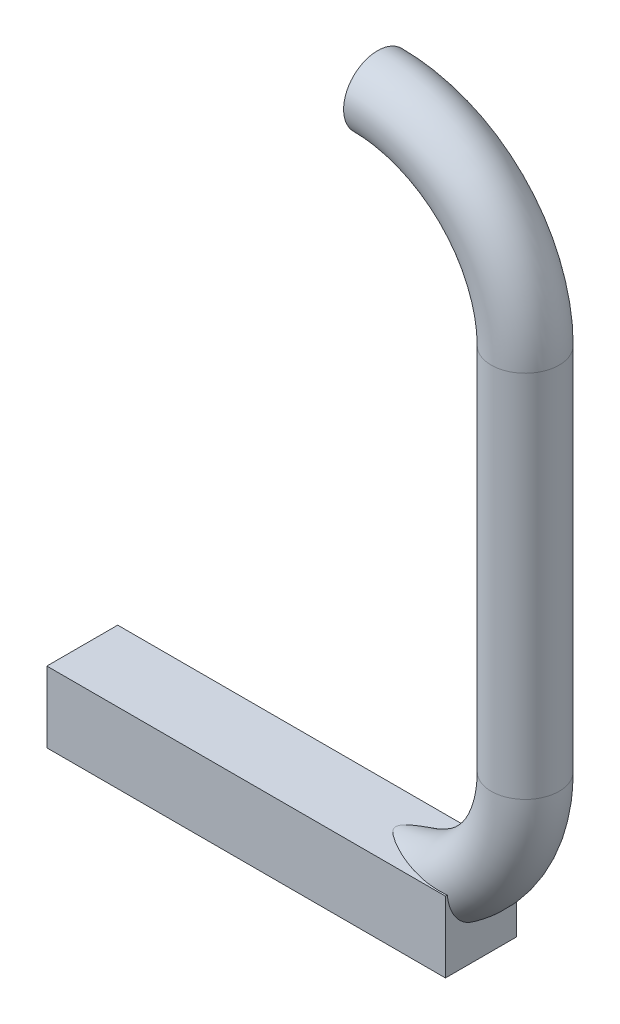
ISO-10303-21;
HEADER;
FILE_DESCRIPTION(('STEP AP214'),'2;1');
FILE_NAME('part.step','',(''),(''),'','','');
FILE_SCHEMA(('AUTOMOTIVE_DESIGN { 1 0 10303 214 1 1 1 1 }'));
ENDSEC;
DATA;
#1=APPLICATION_CONTEXT('core data for automotive mechanical design processes');
#2=APPLICATION_PROTOCOL_DEFINITION('international standard','automotive_design',2000,#1);
#3=PRODUCT_CONTEXT('',#1,'mechanical');
#4=PRODUCT('Part','Part','',(#3));
#5=PRODUCT_RELATED_PRODUCT_CATEGORY('part','',(#4));
#6=PRODUCT_DEFINITION_FORMATION('','',#4);
#7=PRODUCT_DEFINITION_CONTEXT('part definition',#1,'design');
#8=PRODUCT_DEFINITION('design','',#6,#7);
#9=PRODUCT_DEFINITION_SHAPE('','',#8);
#10=(LENGTH_UNIT() NAMED_UNIT(*) SI_UNIT(.MILLI.,.METRE.));
#11=(NAMED_UNIT(*) PLANE_ANGLE_UNIT() SI_UNIT($,.RADIAN.));
#12=(NAMED_UNIT(*) SI_UNIT($,.STERADIAN.) SOLID_ANGLE_UNIT());
#13=UNCERTAINTY_MEASURE_WITH_UNIT(LENGTH_MEASURE(1.E-05),#10,'distance_accuracy_value','');
#14=(GEOMETRIC_REPRESENTATION_CONTEXT(3) GLOBAL_UNCERTAINTY_ASSIGNED_CONTEXT((#13)) GLOBAL_UNIT_ASSIGNED_CONTEXT((#10,
#11,#12)) REPRESENTATION_CONTEXT('',''));
#15=CARTESIAN_POINT('',(0.,0.,0.));
#16=DIRECTION('',(0.,0.,1.));
#17=DIRECTION('',(1.,0.,0.));
#18=AXIS2_PLACEMENT_3D('',#15,#16,#17);
#19=CARTESIAN_POINT('',(-10.,35.,0.));
#20=DIRECTION('',(1.,0.,0.));
#21=DIRECTION('',(0.,0.,-1.));
#22=AXIS2_PLACEMENT_3D('',#19,#20,#21);
#23=PLANE('',#22);
#24=CARTESIAN_POINT('',(-10.,35.,0.));
#25=DIRECTION('',(1.,0.,0.));
#26=DIRECTION('',(0.,0.,-1.));
#27=AXIS2_PLACEMENT_3D('',#24,#25,#26);
#28=CIRCLE('',#27,2.3);
#29=CARTESIAN_POINT('',(-10.,35.,-2.3));
#30=VERTEX_POINT('',#29);
#31=EDGE_CURVE('E66',#30,#30,#28,.T.);
#32=ORIENTED_EDGE('',*,*,#31,.F.);
#33=EDGE_LOOP('',(#32));
#34=FACE_BOUND('',#33,.T.);
#35=ADVANCED_FACE('F45',(#34),#23,.F.);
#36=CARTESIAN_POINT('',(-10.,0.,0.));
#37=DIRECTION('',(0.,0.,1.));
#38=DIRECTION('',(1.,0.,0.));
#39=AXIS2_PLACEMENT_3D('',#36,#37,#38);
#40=TOROIDAL_SURFACE('',#39,10.,2.3);
#41=CARTESIAN_POINT('',(-3.,-10.0595204326185,-0.450923927062551));
#42=CARTESIAN_POINT('',(-3.,-10.0850865922936,-0.345966798105976));
#43=CARTESIAN_POINT('',(-3.,-10.1018228645208,-0.238853486872141));
#44=CARTESIAN_POINT('',(-3.,-10.1167855077667,-0.0233377880273383));
#45=CARTESIAN_POINT('',(-3.,-10.1150138796625,0.0850644589719768));
#46=CARTESIAN_POINT('',(-3.,-10.0930610314419,0.299909944396523));
#47=CARTESIAN_POINT('',(-3.,-10.0728903010278,0.406354263804018));
#48=CARTESIAN_POINT('',(-3.,-10.0151820905365,0.614404784386994));
#49=CARTESIAN_POINT('',(-3.,-9.97764186408039,0.716010217658566));
#50=CARTESIAN_POINT('',(-3.,-9.88633124866035,0.913262219490454));
#51=CARTESIAN_POINT('',(-3.,-9.83234909263179,1.00881011069813));
#52=CARTESIAN_POINT('',(-3.,-9.71060101828803,1.19062378822087));
#53=CARTESIAN_POINT('',(-3.,-9.64283195707754,1.27688745121321));
#54=CARTESIAN_POINT('',(-3.,-9.48793680595565,1.44778267188152));
#55=CARTESIAN_POINT('',(-3.,-9.3995107126304,1.53123220074621));
#56=CARTESIAN_POINT('',(-3.,-9.21173612037597,1.68471859938472));
#57=CARTESIAN_POINT('',(-3.,-9.11238016255341,1.75474621911467));
#58=CARTESIAN_POINT('',(-3.,-8.85901566705753,1.90976222676069));
#59=CARTESIAN_POINT('',(-3.,-8.70047646167985,1.98738077676751));
#60=CARTESIAN_POINT('',(-3.,-8.37289844722519,2.1157978195985));
#61=CARTESIAN_POINT('',(-3.,-8.20384107783171,2.16654730786618));
#62=CARTESIAN_POINT('',(-3.,-7.80444436848786,2.25588462186827));
#63=CARTESIAN_POINT('',(-3.,-7.57203681155976,2.28516716936277));
#64=CARTESIAN_POINT('',(-3.,-7.1055269592388,2.30607243195032));
#65=CARTESIAN_POINT('',(-3.,-6.87142253893703,2.29763448652288));
#66=CARTESIAN_POINT('',(-3.,-6.4874770172784,2.25668212424956));
#67=CARTESIAN_POINT('',(-3.,-6.33653659042456,2.23351975578051));
#68=CARTESIAN_POINT('',(-3.,-6.03719052203209,2.17435500890801));
#69=CARTESIAN_POINT('',(-3.,-5.88878477110618,2.13835318608286));
#70=CARTESIAN_POINT('',(-3.,-5.59529794018598,2.05434468515866));
#71=CARTESIAN_POINT('',(-3.,-5.45021985382563,2.00632762728168));
#72=CARTESIAN_POINT('',(-3.,-5.16442121321652,1.89884276295196));
#73=CARTESIAN_POINT('',(-3.,-5.02369875280009,1.83938005016144));
#74=CARTESIAN_POINT('',(-3.,-4.79786604169187,1.73275040870475));
#75=CARTESIAN_POINT('',(-3.,-4.71114060290708,1.68897479601162));
#76=CARTESIAN_POINT('',(-3.,-4.54026585710975,1.59666985711355));
#77=CARTESIAN_POINT('',(-3.,-4.45611602204963,1.54814151399361));
#78=CARTESIAN_POINT('',(-3.,-4.2910977947158,1.44616466449497));
#79=CARTESIAN_POINT('',(-3.,-4.21022251857459,1.39272734440282));
#80=CARTESIAN_POINT('',(-3.,-4.05239358013626,1.28038402767899));
#81=CARTESIAN_POINT('',(-3.,-3.97543790627031,1.22148088085713));
#82=CARTESIAN_POINT('',(-3.,-3.82449719832431,1.09560633289273));
#83=CARTESIAN_POINT('',(-3.,-3.75066578570998,1.02844878168371));
#84=CARTESIAN_POINT('',(-3.,-3.61080231328726,0.886267940210698));
#85=CARTESIAN_POINT('',(-3.,-3.54476856200611,0.811246362505232));
#86=CARTESIAN_POINT('',(-3.,-3.43941905296488,0.671294664782384));
#87=CARTESIAN_POINT('',(-3.,-3.39751058862841,0.608344911105427));
#88=CARTESIAN_POINT('',(-3.,-3.32375019878203,0.47678256158333));
#89=CARTESIAN_POINT('',(-3.,-3.29187431066808,0.408183960495214));
#90=CARTESIAN_POINT('',(-3.,-3.24826649964847,0.283696413882194));
#91=CARTESIAN_POINT('',(-3.,-3.23349659054943,0.228888316984574));
#92=CARTESIAN_POINT('',(-3.,-3.21341000927301,0.117575047145494));
#93=CARTESIAN_POINT('',(-3.,-3.20808155238705,0.0610720794806092));
#94=CARTESIAN_POINT('',(-3.,-3.20754543974805,-0.0520959634032782));
#95=CARTESIAN_POINT('',(-3.,-3.21235786023321,-0.108761137982623));
#96=CARTESIAN_POINT('',(-3.,-3.231512953531,-0.220463077517019));
#97=CARTESIAN_POINT('',(-3.,-3.24586681073588,-0.275497852154654));
#98=CARTESIAN_POINT('',(-3.,-3.28905866838386,-0.401753758158875));
#99=CARTESIAN_POINT('',(-3.,-3.32122322650039,-0.471818955766654));
#100=CARTESIAN_POINT('',(-3.,-3.39601893327519,-0.606120249813533));
#101=CARTESIAN_POINT('',(-3.,-3.43867889734456,-0.670339619884765));
#102=CARTESIAN_POINT('',(-3.,-3.52665466236531,-0.787157411605189));
#103=CARTESIAN_POINT('',(-3.,-3.57129276946506,-0.840277217326418));
#104=CARTESIAN_POINT('',(-3.,-3.66493783611536,-0.942552217917257));
#105=CARTESIAN_POINT('',(-3.,-3.71394845160234,-0.991704028417386));
#106=CARTESIAN_POINT('',(-3.,-3.81536468836965,-1.0865602288091));
#107=CARTESIAN_POINT('',(-3.,-3.86777718809988,-1.13225720235978));
#108=CARTESIAN_POINT('',(-3.,-3.97521980583419,-1.22047859984916));
#109=CARTESIAN_POINT('',(-3.,-4.03025089543214,-1.26300183094213));
#110=CARTESIAN_POINT('',(-3.,-4.19651684262932,-1.38479529253682));
#111=CARTESIAN_POINT('',(-3.,-4.31077444994434,-1.45995708648754));
#112=CARTESIAN_POINT('',(-3.,-4.54516861944771,-1.60054687824412));
#113=CARTESIAN_POINT('',(-3.,-4.66531011709101,-1.66596651176856));
#114=CARTESIAN_POINT('',(-3.,-4.91029616827658,-1.78765095208152));
#115=CARTESIAN_POINT('',(-3.,-5.03514558058968,-1.8439059634417));
#116=CARTESIAN_POINT('',(-3.,-5.28857467437189,-1.94726178017489));
#117=CARTESIAN_POINT('',(-3.,-5.41715464467042,-1.99436187456537));
#118=CARTESIAN_POINT('',(-3.,-5.68542892429698,-2.08176785176833));
#119=CARTESIAN_POINT('',(-3.,-5.82531986947735,-2.12147621260049));
#120=CARTESIAN_POINT('',(-3.,-6.10778472147352,-2.18966956330348));
#121=CARTESIAN_POINT('',(-3.,-6.25035923913416,-2.2181519647017));
#122=CARTESIAN_POINT('',(-3.,-6.68036807013816,-2.28536349974699));
#123=CARTESIAN_POINT('',(-3.,-6.97104176368199,-2.30617558321387));
#124=CARTESIAN_POINT('',(-3.,-7.46061826015328,-2.29304933287129));
#125=CARTESIAN_POINT('',(-3.,-7.65998015737501,-2.27411008517307));
#126=CARTESIAN_POINT('',(-3.,-8.05349637727916,-2.2055010868768));
#127=CARTESIAN_POINT('',(-3.,-8.24765618824872,-2.15586517038215));
#128=CARTESIAN_POINT('',(-3.,-8.58505056656731,-2.03633232647364));
#129=CARTESIAN_POINT('',(-3.,-8.73051314298438,-1.97274790414527));
#130=CARTESIAN_POINT('',(-3.,-9.00931297230137,-1.82287282312488));
#131=CARTESIAN_POINT('',(-3.,-9.14266350448063,-1.73660744552577));
#132=CARTESIAN_POINT('',(-3.,-9.36863174075163,-1.55907996774789));
#133=CARTESIAN_POINT('',(-3.,-9.46423635020208,-1.47162765317341));
#134=CARTESIAN_POINT('',(-3.,-9.63977221862251,-1.28214739272353));
#135=CARTESIAN_POINT('',(-3.,-9.71971688801582,-1.18013204851832));
#136=CARTESIAN_POINT('',(-3.,-9.85149487433779,-0.976605925974395));
#137=CARTESIAN_POINT('',(-3.,-9.90556610303361,-0.876546965349489));
#138=CARTESIAN_POINT('',(-3.,-9.99616494361971,-0.668755060287398));
#139=CARTESIAN_POINT('',(-3.,-10.0327010653546,-0.561025867448519));
#140=CARTESIAN_POINT('',(-3.,-10.0595204326185,-0.450923927062551));
#141=B_SPLINE_CURVE_WITH_KNOTS('',3,(#41,#42,#43,#44,#45,#46,#47,#48,#49,#50,#51,#52,#53,#54,
#55,#56,#57,#58,#59,#60,#61,#62,#63,#64,#65,#66,#67,#68,#69,#70,#71,#72,#73,#74,#75,#76,#77,#78,
#79,#80,#81,#82,#83,#84,#85,#86,#87,#88,#89,#90,#91,#92,#93,#94,#95,#96,#97,#98,#99,#100,#101,
#102,#103,#104,#105,#106,#107,#108,#109,#110,#111,#112,#113,#114,#115,#116,#117,#118,#119,#120,
#121,#122,#123,#124,#125,#126,#127,#128,#129,#130,#131,#132,#133,#134,#135,#136,#137,#138,#139,
#140),.UNSPECIFIED.,.T.,.F.,(4,2,2,2,2,2,2,2,2,2,2,2,2,2,2,2,2,2,2,2,2,2,2,2,2,2,2,2,2,2,2,2,2,
2,2,2,2,2,2,2,2,2,2,2,2,2,2,2,2,4),(0.,0.323685531492289,0.647336069911499,0.970802203828777,
1.29431950010235,1.6221936838384,1.95014269446515,2.31350343432469,2.67711369990452,
3.20375399239772,3.73135150617938,4.43032848590882,5.13042993522063,5.58802876879848,
6.04560780393871,6.50358350763297,6.96135586756634,7.25267040049132,7.54392480282116,
7.83453123909231,8.12498699935451,8.42397313702059,8.72289429885295,8.949147683604,
9.17485649211519,9.34444416624477,9.51382001354154,9.68353149493556,9.85344226233903,
10.0834205355146,10.3140374076898,10.5218927567197,10.7299235561084,10.9383889423522,
11.1469322894674,11.5565845837529,11.9665865882934,12.3770239805177,12.7874932351094,
13.2232563367553,13.6591198576038,14.5278618301809,15.1267435200429,15.7249662914802,
16.1994797247986,16.6734664725434,17.0606301567534,17.4474608289919,17.7871778813569,
18.1267299008001),.UNSPECIFIED.);
#142=CARTESIAN_POINT('',(-3.,-7.6,-2.27584306344525));
#143=VERTEX_POINT('',#142);
#144=CARTESIAN_POINT('',(-3.,-7.6,2.27584306344519));
#145=VERTEX_POINT('',#144);
#146=EDGE_CURVE('E56',#143,#145,#141,.T.);
#147=ORIENTED_EDGE('',*,*,#146,.F.);
#148=CARTESIAN_POINT('',(-8.76106516328514,-7.6,-0.0384874427780604));
#149=CARTESIAN_POINT('',(-8.76336745512046,-7.6,-0.0163076647818836));
#150=CARTESIAN_POINT('',(-8.76368354584691,-7.6,0.00610174449860957));
#151=CARTESIAN_POINT('',(-8.7602780285064,-7.6,0.050605825243175));
#152=CARTESIAN_POINT('',(-8.7565533131262,-7.6,0.0727002412371014));
#153=CARTESIAN_POINT('',(-8.74415273225032,-7.6,0.121689200166704));
#154=CARTESIAN_POINT('',(-8.73443001200933,-7.6,0.148312580619611));
#155=CARTESIAN_POINT('',(-8.71092306107291,-7.6,0.199700397722118));
#156=CARTESIAN_POINT('',(-8.69712691934324,-7.6,0.224459111652509));
#157=CARTESIAN_POINT('',(-8.66375926401956,-7.6,0.276963169015735));
#158=CARTESIAN_POINT('',(-8.64358456218863,-7.6,0.304316569600383));
#159=CARTESIAN_POINT('',(-8.60069675648798,-7.6,0.356982318017975));
#160=CARTESIAN_POINT('',(-8.57797881071123,-7.6,0.382290609076778));
#161=CARTESIAN_POINT('',(-8.53072229662973,-7.6,0.431429046384539));
#162=CARTESIAN_POINT('',(-8.50617331872111,-7.6,0.455249061080922));
#163=CARTESIAN_POINT('',(-8.45591175864558,-7.6,0.50156570179265));
#164=CARTESIAN_POINT('',(-8.43020026816034,-7.6,0.524063525574512));
#165=CARTESIAN_POINT('',(-8.35018341661451,-7.6,0.591365096243037));
#166=CARTESIAN_POINT('',(-8.29448581460041,-7.6,0.634507302628828));
#167=CARTESIAN_POINT('',(-8.1809350488034,-7.6,0.717876129763391));
#168=CARTESIAN_POINT('',(-8.12308031674518,-7.6,0.758100564094274));
#169=CARTESIAN_POINT('',(-8.00578344977357,-7.6,0.836438577242294));
#170=CARTESIAN_POINT('',(-7.94633816716617,-7.6,0.874547428009476));
#171=CARTESIAN_POINT('',(-7.82634836543142,-7.6,0.948998789112317));
#172=CARTESIAN_POINT('',(-7.76580370079169,-7.6,0.985341063251358));
#173=CARTESIAN_POINT('',(-7.58265877877051,-7.6,1.09224266896904));
#174=CARTESIAN_POINT('',(-7.45874068279682,-7.6,1.16055099614725));
#175=CARTESIAN_POINT('',(-7.20843153181569,-7.6,1.29201654085484));
#176=CARTESIAN_POINT('',(-7.08204384651307,-7.6,1.35518024218859));
#177=CARTESIAN_POINT('',(-6.74396172047494,-7.6,1.51617947177852));
#178=CARTESIAN_POINT('',(-6.5302579020165,-7.6,1.60984027517238));
#179=CARTESIAN_POINT('',(-6.09694068122383,-7.6,1.78296132569362));
#180=CARTESIAN_POINT('',(-5.8773223166303,-7.6,1.86240919237886));
#181=CARTESIAN_POINT('',(-5.43377892346578,-7.6,2.00423250490061));
#182=CARTESIAN_POINT('',(-5.20988093762913,-7.6,2.06669137408837));
#183=CARTESIAN_POINT('',(-4.75750441952767,-7.6,2.17178324850581));
#184=CARTESIAN_POINT('',(-4.52902822197315,-7.6,2.21442610358707));
#185=CARTESIAN_POINT('',(-4.05329032030783,-7.6,2.27792287317266));
#186=CARTESIAN_POINT('',(-3.80579656658777,-7.6,2.29712330020667));
#187=CARTESIAN_POINT('',(-3.31006826701693,-7.6,2.30227961027013));
#188=CARTESIAN_POINT('',(-3.06183364135996,-7.6,2.28823177248211));
#189=CARTESIAN_POINT('',(-2.61689143468955,-7.6,2.22616057736104));
#190=CARTESIAN_POINT('',(-2.41925426657746,-7.6,2.18500596755682));
#191=CARTESIAN_POINT('',(-2.03294356913534,-7.6,2.07183091496381));
#192=CARTESIAN_POINT('',(-1.84425479039484,-7.6,1.99986524469287));
#193=CARTESIAN_POINT('',(-1.53327215252863,-7.6,1.84586875798378));
#194=CARTESIAN_POINT('',(-1.40694964596323,-7.6,1.77199542395462));
#195=CARTESIAN_POINT('',(-1.16756428787725,-7.6,1.60512188886672));
#196=CARTESIAN_POINT('',(-1.05448584184775,-7.6,1.51214454505752));
#197=CARTESIAN_POINT('',(-0.865315117179502,-7.6,1.32540192997881));
#198=CARTESIAN_POINT('',(-0.786219043340599,-7.6,1.23469035583397));
#199=CARTESIAN_POINT('',(-0.644012137334367,-7.6,1.04140472431223));
#200=CARTESIAN_POINT('',(-0.580895862654296,-7.6,0.938834723146037));
#201=CARTESIAN_POINT('',(-0.473711533522327,-7.6,0.723180144342138));
#202=CARTESIAN_POINT('',(-0.429779886446887,-7.6,0.610027001012858));
#203=CARTESIAN_POINT('',(-0.364588327368235,-7.6,0.377355504592211));
#204=CARTESIAN_POINT('',(-0.3433123936587,-7.6,0.257841712520241));
#205=CARTESIAN_POINT('',(-0.326079630234177,-7.6,0.0317091322237236));
#206=CARTESIAN_POINT('',(-0.327352658772131,-7.6,-0.0747057133016944));
#207=CARTESIAN_POINT('',(-0.348448470927228,-7.6,-0.285655333252143));
#208=CARTESIAN_POINT('',(-0.368266891221725,-7.6,-0.39019054401764));
#209=CARTESIAN_POINT('',(-0.424330994369228,-7.6,-0.590860124880144));
#210=CARTESIAN_POINT('',(-0.45999405900148,-7.6,-0.687159366275498));
#211=CARTESIAN_POINT('',(-0.545816476709432,-7.6,-0.873023596316549));
#212=CARTESIAN_POINT('',(-0.595978261926194,-7.6,-0.962587451931074));
#213=CARTESIAN_POINT('',(-0.713230524228457,-7.6,-1.14031141654994));
#214=CARTESIAN_POINT('',(-0.781353729036768,-7.6,-1.2277869570745));
#215=CARTESIAN_POINT('',(-0.929364505230641,-7.6,-1.39208751767257));
#216=CARTESIAN_POINT('',(-1.00925893658261,-7.6,-1.46890627621963));
#217=CARTESIAN_POINT('',(-1.21688994804331,-7.6,-1.64405208728221));
#218=CARTESIAN_POINT('',(-1.34983591404349,-7.6,-1.73622575498108));
#219=CARTESIAN_POINT('',(-1.6289202771372,-7.6,-1.89782465763377));
#220=CARTESIAN_POINT('',(-1.77508631340205,-7.6,-1.96720075910756));
#221=CARTESIAN_POINT('',(-2.13287295036862,-7.6,-2.10719761437403));
#222=CARTESIAN_POINT('',(-2.3482246420962,-7.6,-2.16823369493722));
#223=CARTESIAN_POINT('',(-2.78560156175981,-7.6,-2.25546474153732));
#224=CARTESIAN_POINT('',(-3.00763257356028,-7.6,-2.28162856730029));
#225=CARTESIAN_POINT('',(-3.39939569692146,-7.6,-2.30183381598157));
#226=CARTESIAN_POINT('',(-3.56887006693146,-7.6,-2.30208495022328));
#227=CARTESIAN_POINT('',(-3.9072060875237,-7.6,-2.28778514855288));
#228=CARTESIAN_POINT('',(-4.07606756025928,-7.6,-2.27323021485007));
#229=CARTESIAN_POINT('',(-4.41278806100772,-7.6,-2.23113580687514));
#230=CARTESIAN_POINT('',(-4.58064057281336,-7.6,-2.20354570206804));
#231=CARTESIAN_POINT('',(-4.91400962297039,-7.6,-2.13704245413604));
#232=CARTESIAN_POINT('',(-5.07952669164114,-7.6,-2.09813192643016));
#233=CARTESIAN_POINT('',(-5.47589007908178,-7.6,-1.99225863686999));
#234=CARTESIAN_POINT('',(-5.70541410960165,-7.6,-1.92035133764394));
#235=CARTESIAN_POINT('',(-6.15875375081709,-7.6,-1.75995673435875));
#236=CARTESIAN_POINT('',(-6.38256412105976,-7.6,-1.6714547898201));
#237=CARTESIAN_POINT('',(-6.71302666710877,-7.6,-1.52806455063566));
#238=CARTESIAN_POINT('',(-6.82207460127687,-7.6,-1.47861354645099));
#239=CARTESIAN_POINT('',(-7.03850897952975,-7.6,-1.37620479371858));
#240=CARTESIAN_POINT('',(-7.14589553797288,-7.6,-1.32324728787251));
#241=CARTESIAN_POINT('',(-7.35872706148894,-7.6,-1.2138031142897));
#242=CARTESIAN_POINT('',(-7.4641737696357,-7.6,-1.15731983760317));
#243=CARTESIAN_POINT('',(-7.67284681056368,-7.6,-1.04041476422357));
#244=CARTESIAN_POINT('',(-7.7760736169333,-7.6,-0.979993818894617));
#245=CARTESIAN_POINT('',(-7.94965103634413,-7.6,-0.872619219978699));
#246=CARTESIAN_POINT('',(-8.02076669326691,-7.6,-0.826911305038145));
#247=CARTESIAN_POINT('',(-8.16106920104117,-7.6,-0.732028068821592));
#248=CARTESIAN_POINT('',(-8.23024705652046,-7.6,-0.682839432972126));
#249=CARTESIAN_POINT('',(-8.36576856190612,-7.6,-0.579135223034747));
#250=CARTESIAN_POINT('',(-8.43207699412326,-7.6,-0.524571341845365));
#251=CARTESIAN_POINT('',(-8.52561044421471,-7.6,-0.436639095887827));
#252=CARTESIAN_POINT('',(-8.55573636693094,-7.6,-0.406391865606841));
#253=CARTESIAN_POINT('',(-8.61283534804199,-7.6,-0.343091496041696));
#254=CARTESIAN_POINT('',(-8.63981657703006,-7.6,-0.31004603165067));
#255=CARTESIAN_POINT('',(-8.68062691466977,-7.6,-0.251388569662167));
#256=CARTESIAN_POINT('',(-8.69589759654138,-7.6,-0.226795746482159));
#257=CARTESIAN_POINT('',(-8.72269575095602,-7.6,-0.175681462861518));
#258=CARTESIAN_POINT('',(-8.73423871921051,-7.6,-0.149168562276878));
#259=CARTESIAN_POINT('',(-8.74753202458679,-7.6,-0.108270301040698));
#260=CARTESIAN_POINT('',(-8.75128269168518,-7.6,-0.0945314070965243));
#261=CARTESIAN_POINT('',(-8.75731462296484,-7.6,-0.0667221832053032));
#262=CARTESIAN_POINT('',(-8.75959490018452,-7.6,-0.0526516371983649));
#263=CARTESIAN_POINT('',(-8.76106516328514,-7.6,-0.0384874427780604));
#264=B_SPLINE_CURVE_WITH_KNOTS('',3,(#148,#149,#150,#151,#152,#153,#154,#155,#156,#157,#158,
#159,#160,#161,#162,#163,#164,#165,#166,#167,#168,#169,#170,#171,#172,#173,#174,#175,#176,#177,
#178,#179,#180,#181,#182,#183,#184,#185,#186,#187,#188,#189,#190,#191,#192,#193,#194,#195,#196,
#197,#198,#199,#200,#201,#202,#203,#204,#205,#206,#207,#208,#209,#210,#211,#212,#213,#214,#215,
#216,#217,#218,#219,#220,#221,#222,#223,#224,#225,#226,#227,#228,#229,#230,#231,#232,#233,#234,
#235,#236,#237,#238,#239,#240,#241,#242,#243,#244,#245,#246,#247,#248,#249,#250,#251,#252,#253,
#254,#255,#256,#257,#258,#259,#260,#261,#262,#263),.UNSPECIFIED.,.T.,.F.,(4,2,2,2,2,2,2,2,2,2,2,
2,2,2,2,2,2,2,2,2,2,2,2,2,2,2,2,2,2,2,2,2,2,2,2,2,2,2,2,2,2,2,2,2,2,2,2,2,2,2,2,2,2,2,2,2,2,4),
(0.,0.0668389499634032,0.133729334433175,0.218264191042858,0.303048725067083,0.404776922555672,
0.506702197216169,0.609259078896643,0.711721575368919,0.922904241808192,1.13424355622937,
1.34603759932495,1.55785988246924,1.98219497544362,2.40598672333905,3.10546403355515,
3.80554770079827,4.50212890921284,5.19836349998649,5.94130161228249,6.68432287080672,
7.28794304533168,7.89049459686792,8.32798673643224,8.76495844924527,9.12456870901313,
9.48405632491769,9.84605994178593,10.2078073859528,10.5254597025317,10.8430373012954,
11.1497961592183,11.4566065054254,11.7879433446714,12.1194740478816,12.6020992833456,
13.0857579564989,13.7535798152655,14.4219976278556,14.9297431998397,15.4376259047515,
15.9474977259457,16.4572518420919,17.1780415629404,17.8994702120004,18.2586307193781,
18.6177663934815,18.9765618235024,19.3352799340167,19.5888188388353,19.843386320198,
20.1004969318271,20.2284541037014,20.3560710320784,20.442720337866,20.529004671262,
20.5716599902567,20.6143439108213),.UNSPECIFIED.);
#265=EDGE_CURVE('E12',#143,#145,#264,.T.);
#266=ORIENTED_EDGE('',*,*,#265,.T.);
#267=EDGE_LOOP('',(#147,#266));
#268=FACE_BOUND('',#267,.T.);
#269=CARTESIAN_POINT('',(0.,0.,0.));
#270=DIRECTION('',(0.,-1.,0.));
#271=DIRECTION('',(0.,0.,-1.));
#272=AXIS2_PLACEMENT_3D('',#269,#270,#271);
#273=CIRCLE('',#272,2.3);
#274=CARTESIAN_POINT('',(0.,0.,-2.3));
#275=VERTEX_POINT('',#274);
#276=EDGE_CURVE('E136',#275,#275,#273,.T.);
#277=ORIENTED_EDGE('',*,*,#276,.T.);
#278=EDGE_LOOP('',(#277));
#279=FACE_BOUND('',#278,.T.);
#280=ADVANCED_FACE('F148',(#268,#279),#40,.T.);
#281=CARTESIAN_POINT('',(0.,0.,0.));
#282=DIRECTION('',(0.,1.,0.));
#283=DIRECTION('',(0.,0.,1.));
#284=AXIS2_PLACEMENT_3D('',#281,#282,#283);
#285=CYLINDRICAL_SURFACE('',#284,2.3);
#286=CARTESIAN_POINT('',(0.,25.,0.));
#287=DIRECTION('',(0.,-1.,0.));
#288=DIRECTION('',(0.,0.,-1.));
#289=AXIS2_PLACEMENT_3D('',#286,#287,#288);
#290=CIRCLE('',#289,2.3);
#291=CARTESIAN_POINT('',(0.,25.,-2.3));
#292=VERTEX_POINT('',#291);
#293=EDGE_CURVE('E142',#292,#292,#290,.T.);
#294=ORIENTED_EDGE('',*,*,#293,.T.);
#295=EDGE_LOOP('',(#294));
#296=FACE_BOUND('',#295,.T.);
#297=ORIENTED_EDGE('',*,*,#276,.F.);
#298=EDGE_LOOP('',(#297));
#299=FACE_BOUND('',#298,.T.);
#300=ADVANCED_FACE('F172',(#296,#299),#285,.T.);
#301=CARTESIAN_POINT('',(-10.,25.,0.));
#302=DIRECTION('',(0.,0.,1.));
#303=DIRECTION('',(1.,0.,0.));
#304=AXIS2_PLACEMENT_3D('',#301,#302,#303);
#305=TOROIDAL_SURFACE('',#304,10.,2.3);
#306=ORIENTED_EDGE('',*,*,#31,.T.);
#307=EDGE_LOOP('',(#306));
#308=FACE_BOUND('',#307,.T.);
#309=ORIENTED_EDGE('',*,*,#293,.F.);
#310=EDGE_LOOP('',(#309));
#311=FACE_BOUND('',#310,.T.);
#312=ADVANCED_FACE('F167',(#308,#311),#305,.T.);
#313=CARTESIAN_POINT('',(-3.,-7.6,-2.4));
#314=DIRECTION('',(0.,1.,0.));
#315=DIRECTION('',(-1.,0.,0.));
#316=AXIS2_PLACEMENT_3D('',#313,#314,#315);
#317=PLANE('',#316);
#318=ORIENTED_EDGE('',*,*,#265,.F.);
#319=DIRECTION('',(0.,0.,-1.));
#320=VECTOR('',#319,1.);
#321=CARTESIAN_POINT('',(-3.,-7.6,-2.4));
#322=LINE('',#321,#320);
#323=CARTESIAN_POINT('',(-3.,-7.6,-2.4));
#324=VERTEX_POINT('',#323);
#325=EDGE_CURVE('E126',#143,#324,#322,.T.);
#326=ORIENTED_EDGE('',*,*,#325,.T.);
#327=DIRECTION('',(-1.,0.,0.));
#328=VECTOR('',#327,1.);
#329=CARTESIAN_POINT('',(-3.,-7.6,-2.4));
#330=LINE('',#329,#328);
#331=CARTESIAN_POINT('',(-30.,-7.6,-2.4));
#332=VERTEX_POINT('',#331);
#333=EDGE_CURVE('E105',#324,#332,#330,.T.);
#334=ORIENTED_EDGE('',*,*,#333,.T.);
#335=DIRECTION('',(0.,0.,-1.));
#336=VECTOR('',#335,1.);
#337=CARTESIAN_POINT('',(-30.,-7.6,-2.4));
#338=LINE('',#337,#336);
#339=CARTESIAN_POINT('',(-30.,-7.6,2.4));
#340=VERTEX_POINT('',#339);
#341=EDGE_CURVE('E109',#340,#332,#338,.T.);
#342=ORIENTED_EDGE('',*,*,#341,.F.);
#343=DIRECTION('',(-1.,0.,0.));
#344=VECTOR('',#343,1.);
#345=CARTESIAN_POINT('',(-3.,-7.6,2.4));
#346=LINE('',#345,#344);
#347=CARTESIAN_POINT('',(-3.,-7.6,2.4));
#348=VERTEX_POINT('',#347);
#349=EDGE_CURVE('E95',#348,#340,#346,.T.);
#350=ORIENTED_EDGE('',*,*,#349,.F.);
#351=EDGE_CURVE('E127',#348,#145,#322,.T.);
#352=ORIENTED_EDGE('',*,*,#351,.T.);
#353=EDGE_LOOP('',(#318,#326,#334,#342,#350,#352));
#354=FACE_BOUND('',#353,.T.);
#355=ADVANCED_FACE('F110',(#354),#317,.T.);
#356=CARTESIAN_POINT('',(-3.,0.,0.));
#357=DIRECTION('',(-1.,0.,0.));
#358=DIRECTION('',(0.,0.,1.));
#359=AXIS2_PLACEMENT_3D('',#356,#357,#358);
#360=PLANE('',#359);
#361=ORIENTED_EDGE('',*,*,#325,.F.);
#362=ORIENTED_EDGE('',*,*,#146,.T.);
#363=ORIENTED_EDGE('',*,*,#351,.F.);
#364=DIRECTION('',(0.,1.,0.));
#365=VECTOR('',#364,1.);
#366=CARTESIAN_POINT('',(-3.,-7.6,2.4));
#367=LINE('',#366,#365);
#368=CARTESIAN_POINT('',(-3.,-12.4,2.4));
#369=VERTEX_POINT('',#368);
#370=EDGE_CURVE('E101',#369,#348,#367,.T.);
#371=ORIENTED_EDGE('',*,*,#370,.F.);
#372=DIRECTION('',(0.,0.,1.));
#373=VECTOR('',#372,1.);
#374=CARTESIAN_POINT('',(-3.,-12.4,-2.4));
#375=LINE('',#374,#373);
#376=CARTESIAN_POINT('',(-3.,-12.4,-2.4));
#377=VERTEX_POINT('',#376);
#378=EDGE_CURVE('E106',#377,#369,#375,.T.);
#379=ORIENTED_EDGE('',*,*,#378,.F.);
#380=DIRECTION('',(0.,-1.,0.));
#381=VECTOR('',#380,1.);
#382=CARTESIAN_POINT('',(-3.,-7.6,-2.4));
#383=LINE('',#382,#381);
#384=EDGE_CURVE('E129',#324,#377,#383,.T.);
#385=ORIENTED_EDGE('',*,*,#384,.F.);
#386=EDGE_LOOP('',(#361,#362,#363,#371,#379,#385));
#387=FACE_BOUND('',#386,.T.);
#388=ADVANCED_FACE('F152',(#387),#360,.F.);
#389=CARTESIAN_POINT('',(-3.,-7.6,2.4));
#390=DIRECTION('',(0.,0.,1.));
#391=DIRECTION('',(0.,-1.,0.));
#392=AXIS2_PLACEMENT_3D('',#389,#390,#391);
#393=PLANE('',#392);
#394=ORIENTED_EDGE('',*,*,#349,.T.);
#395=DIRECTION('',(0.,1.,0.));
#396=VECTOR('',#395,1.);
#397=CARTESIAN_POINT('',(-30.,-7.6,2.4));
#398=LINE('',#397,#396);
#399=CARTESIAN_POINT('',(-30.,-12.4,2.4));
#400=VERTEX_POINT('',#399);
#401=EDGE_CURVE('E99',#400,#340,#398,.T.);
#402=ORIENTED_EDGE('',*,*,#401,.F.);
#403=DIRECTION('',(-1.,0.,0.));
#404=VECTOR('',#403,1.);
#405=CARTESIAN_POINT('',(-3.,-12.4,2.4));
#406=LINE('',#405,#404);
#407=EDGE_CURVE('E134',#369,#400,#406,.T.);
#408=ORIENTED_EDGE('',*,*,#407,.F.);
#409=ORIENTED_EDGE('',*,*,#370,.T.);
#410=EDGE_LOOP('',(#394,#402,#408,#409));
#411=FACE_BOUND('',#410,.T.);
#412=ADVANCED_FACE('F97',(#411),#393,.T.);
#413=CARTESIAN_POINT('',(-3.,-12.4,-2.4));
#414=DIRECTION('',(0.,-1.,0.));
#415=DIRECTION('',(1.,0.,0.));
#416=AXIS2_PLACEMENT_3D('',#413,#414,#415);
#417=PLANE('',#416);
#418=ORIENTED_EDGE('',*,*,#407,.T.);
#419=DIRECTION('',(0.,0.,1.));
#420=VECTOR('',#419,1.);
#421=CARTESIAN_POINT('',(-30.,-12.4,-2.4));
#422=LINE('',#421,#420);
#423=CARTESIAN_POINT('',(-30.,-12.4,-2.4));
#424=VERTEX_POINT('',#423);
#425=EDGE_CURVE('E120',#424,#400,#422,.T.);
#426=ORIENTED_EDGE('',*,*,#425,.F.);
#427=DIRECTION('',(-1.,0.,0.));
#428=VECTOR('',#427,1.);
#429=CARTESIAN_POINT('',(-3.,-12.4,-2.4));
#430=LINE('',#429,#428);
#431=EDGE_CURVE('E137',#377,#424,#430,.T.);
#432=ORIENTED_EDGE('',*,*,#431,.F.);
#433=ORIENTED_EDGE('',*,*,#378,.T.);
#434=EDGE_LOOP('',(#418,#426,#432,#433));
#435=FACE_BOUND('',#434,.T.);
#436=ADVANCED_FACE('F158',(#435),#417,.T.);
#437=CARTESIAN_POINT('',(-3.,-7.6,-2.4));
#438=DIRECTION('',(0.,0.,-1.));
#439=DIRECTION('',(0.,1.,0.));
#440=AXIS2_PLACEMENT_3D('',#437,#438,#439);
#441=PLANE('',#440);
#442=ORIENTED_EDGE('',*,*,#431,.T.);
#443=DIRECTION('',(0.,-1.,0.));
#444=VECTOR('',#443,1.);
#445=CARTESIAN_POINT('',(-30.,-7.6,-2.4));
#446=LINE('',#445,#444);
#447=EDGE_CURVE('E115',#332,#424,#446,.T.);
#448=ORIENTED_EDGE('',*,*,#447,.F.);
#449=ORIENTED_EDGE('',*,*,#333,.F.);
#450=ORIENTED_EDGE('',*,*,#384,.T.);
#451=EDGE_LOOP('',(#442,#448,#449,#450));
#452=FACE_BOUND('',#451,.T.);
#453=ADVANCED_FACE('F161',(#452),#441,.T.);
#454=CARTESIAN_POINT('',(-30.,0.,0.));
#455=DIRECTION('',(-1.,0.,0.));
#456=DIRECTION('',(0.,0.,1.));
#457=AXIS2_PLACEMENT_3D('',#454,#455,#456);
#458=PLANE('',#457);
#459=ORIENTED_EDGE('',*,*,#401,.T.);
#460=ORIENTED_EDGE('',*,*,#341,.T.);
#461=ORIENTED_EDGE('',*,*,#447,.T.);
#462=ORIENTED_EDGE('',*,*,#425,.T.);
#463=EDGE_LOOP('',(#459,#460,#461,#462));
#464=FACE_BOUND('',#463,.T.);
#465=ADVANCED_FACE('F118',(#464),#458,.T.);
#466=CLOSED_SHELL('',(#35,#280,#300,#312,#355,#388,#412,#436,#453,#465));
#467=MANIFOLD_SOLID_BREP('B2',#466);
#468=ADVANCED_BREP_SHAPE_REPRESENTATION('',(#18,#467),#14);
#469=SHAPE_DEFINITION_REPRESENTATION(#9,#468);
ENDSEC;
END-ISO-10303-21;
